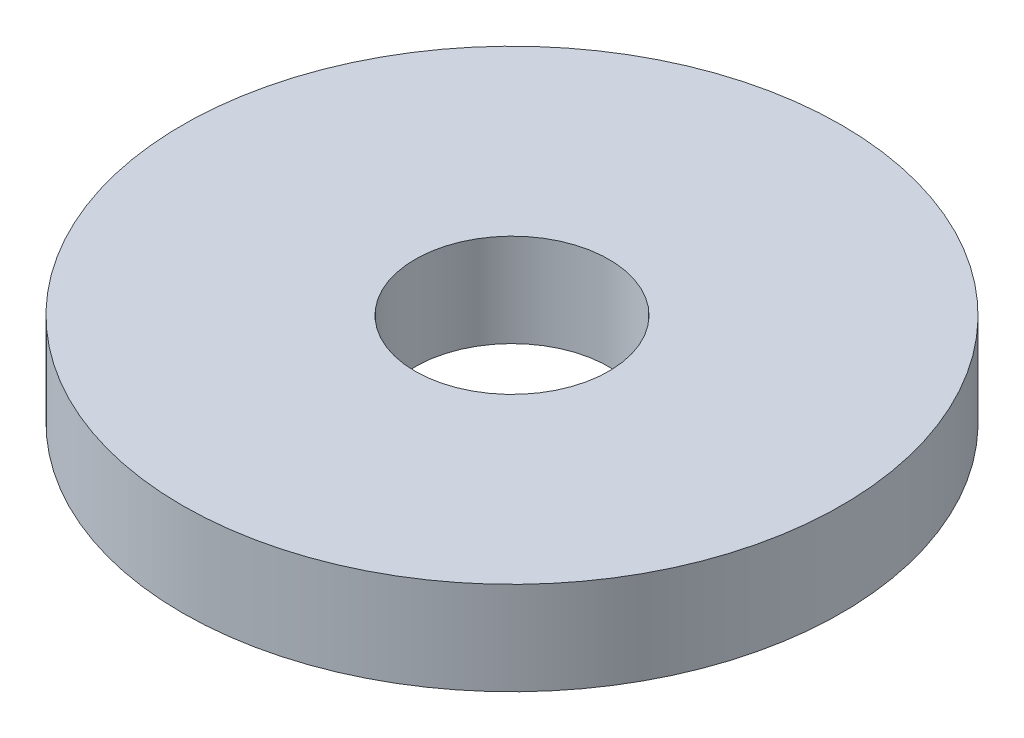
ISO-10303-21;
HEADER;
FILE_DESCRIPTION(('STEP AP214'),'2;1');
FILE_NAME('part.step','',(''),(''),'','','');
FILE_SCHEMA(('AUTOMOTIVE_DESIGN { 1 0 10303 214 1 1 1 1 }'));
ENDSEC;
DATA;
#1=APPLICATION_CONTEXT('core data for automotive mechanical design processes');
#2=APPLICATION_PROTOCOL_DEFINITION('international standard','automotive_design',2000,#1);
#3=PRODUCT_CONTEXT('',#1,'mechanical');
#4=PRODUCT('Part','Part','',(#3));
#5=PRODUCT_RELATED_PRODUCT_CATEGORY('part','',(#4));
#6=PRODUCT_DEFINITION_FORMATION('','',#4);
#7=PRODUCT_DEFINITION_CONTEXT('part definition',#1,'design');
#8=PRODUCT_DEFINITION('design','',#6,#7);
#9=PRODUCT_DEFINITION_SHAPE('','',#8);
#10=(LENGTH_UNIT() NAMED_UNIT(*) SI_UNIT(.MILLI.,.METRE.));
#11=(NAMED_UNIT(*) PLANE_ANGLE_UNIT() SI_UNIT($,.RADIAN.));
#12=(NAMED_UNIT(*) SI_UNIT($,.STERADIAN.) SOLID_ANGLE_UNIT());
#13=UNCERTAINTY_MEASURE_WITH_UNIT(LENGTH_MEASURE(1.E-05),#10,'distance_accuracy_value','');
#14=(GEOMETRIC_REPRESENTATION_CONTEXT(3) GLOBAL_UNCERTAINTY_ASSIGNED_CONTEXT((#13)) GLOBAL_UNIT_ASSIGNED_CONTEXT((#10,
#11,#12)) REPRESENTATION_CONTEXT('',''));
#15=CARTESIAN_POINT('',(0.,0.,0.));
#16=DIRECTION('',(0.,0.,1.));
#17=DIRECTION('',(1.,0.,0.));
#18=AXIS2_PLACEMENT_3D('',#15,#16,#17);
#19=CARTESIAN_POINT('',(0.,24.,0.));
#20=DIRECTION('',(0.,-1.,0.));
#21=DIRECTION('',(0.,0.,-1.));
#22=AXIS2_PLACEMENT_3D('',#19,#20,#21);
#23=CYLINDRICAL_SURFACE('',#22,85.);
#24=CARTESIAN_POINT('',(0.,24.,0.));
#25=DIRECTION('',(0.,1.,0.));
#26=DIRECTION('',(0.,0.,1.));
#27=AXIS2_PLACEMENT_3D('',#24,#25,#26);
#28=CIRCLE('',#27,85.);
#29=CARTESIAN_POINT('',(0.,24.,85.));
#30=VERTEX_POINT('',#29);
#31=EDGE_CURVE('E10',#30,#30,#28,.T.);
#32=ORIENTED_EDGE('',*,*,#31,.F.);
#33=EDGE_LOOP('',(#32));
#34=FACE_BOUND('',#33,.T.);
#35=CARTESIAN_POINT('',(0.,0.,0.));
#36=DIRECTION('',(0.,1.,0.));
#37=DIRECTION('',(0.,0.,1.));
#38=AXIS2_PLACEMENT_3D('',#35,#36,#37);
#39=CIRCLE('',#38,85.);
#40=CARTESIAN_POINT('',(0.,0.,85.));
#41=VERTEX_POINT('',#40);
#42=EDGE_CURVE('E37',#41,#41,#39,.T.);
#43=ORIENTED_EDGE('',*,*,#42,.T.);
#44=EDGE_LOOP('',(#43));
#45=FACE_BOUND('',#44,.T.);
#46=ADVANCED_FACE('F40',(#34,#45),#23,.T.);
#47=CARTESIAN_POINT('',(0.,24.,0.));
#48=DIRECTION('',(0.,1.,0.));
#49=DIRECTION('',(0.,0.,1.));
#50=AXIS2_PLACEMENT_3D('',#47,#48,#49);
#51=PLANE('',#50);
#52=CARTESIAN_POINT('',(0.,24.,0.));
#53=DIRECTION('',(0.,1.,0.));
#54=DIRECTION('',(0.,0.,1.));
#55=AXIS2_PLACEMENT_3D('',#52,#53,#54);
#56=CIRCLE('',#55,25.);
#57=CARTESIAN_POINT('',(0.,24.,25.));
#58=VERTEX_POINT('',#57);
#59=EDGE_CURVE('E50',#58,#58,#56,.T.);
#60=ORIENTED_EDGE('',*,*,#59,.F.);
#61=EDGE_LOOP('',(#60));
#62=FACE_BOUND('',#61,.T.);
#63=ORIENTED_EDGE('',*,*,#31,.T.);
#64=EDGE_LOOP('',(#63));
#65=FACE_BOUND('',#64,.T.);
#66=ADVANCED_FACE('F59',(#62,#65),#51,.T.);
#67=CARTESIAN_POINT('',(0.,0.,0.));
#68=DIRECTION('',(0.,1.,0.));
#69=DIRECTION('',(0.,0.,1.));
#70=AXIS2_PLACEMENT_3D('',#67,#68,#69);
#71=PLANE('',#70);
#72=CARTESIAN_POINT('',(0.,0.,0.));
#73=DIRECTION('',(0.,1.,0.));
#74=DIRECTION('',(0.,0.,1.));
#75=AXIS2_PLACEMENT_3D('',#72,#73,#74);
#76=CIRCLE('',#75,25.);
#77=CARTESIAN_POINT('',(0.,0.,25.));
#78=VERTEX_POINT('',#77);
#79=EDGE_CURVE('E47',#78,#78,#76,.T.);
#80=ORIENTED_EDGE('',*,*,#79,.T.);
#81=EDGE_LOOP('',(#80));
#82=FACE_BOUND('',#81,.T.);
#83=ORIENTED_EDGE('',*,*,#42,.F.);
#84=EDGE_LOOP('',(#83));
#85=FACE_BOUND('',#84,.T.);
#86=ADVANCED_FACE('F58',(#82,#85),#71,.F.);
#87=CARTESIAN_POINT('',(0.,24.,0.));
#88=DIRECTION('',(0.,-1.,0.));
#89=DIRECTION('',(0.,0.,-1.));
#90=AXIS2_PLACEMENT_3D('',#87,#88,#89);
#91=CYLINDRICAL_SURFACE('',#90,25.);
#92=ORIENTED_EDGE('',*,*,#59,.T.);
#93=EDGE_LOOP('',(#92));
#94=FACE_BOUND('',#93,.T.);
#95=ORIENTED_EDGE('',*,*,#79,.F.);
#96=EDGE_LOOP('',(#95));
#97=FACE_BOUND('',#96,.T.);
#98=ADVANCED_FACE('F54',(#94,#97),#91,.F.);
#99=CLOSED_SHELL('',(#46,#66,#86,#98));
#100=MANIFOLD_SOLID_BREP('B2',#99);
#101=ADVANCED_BREP_SHAPE_REPRESENTATION('',(#18,#100),#14);
#102=SHAPE_DEFINITION_REPRESENTATION(#9,#101);
ENDSEC;
END-ISO-10303-21;
